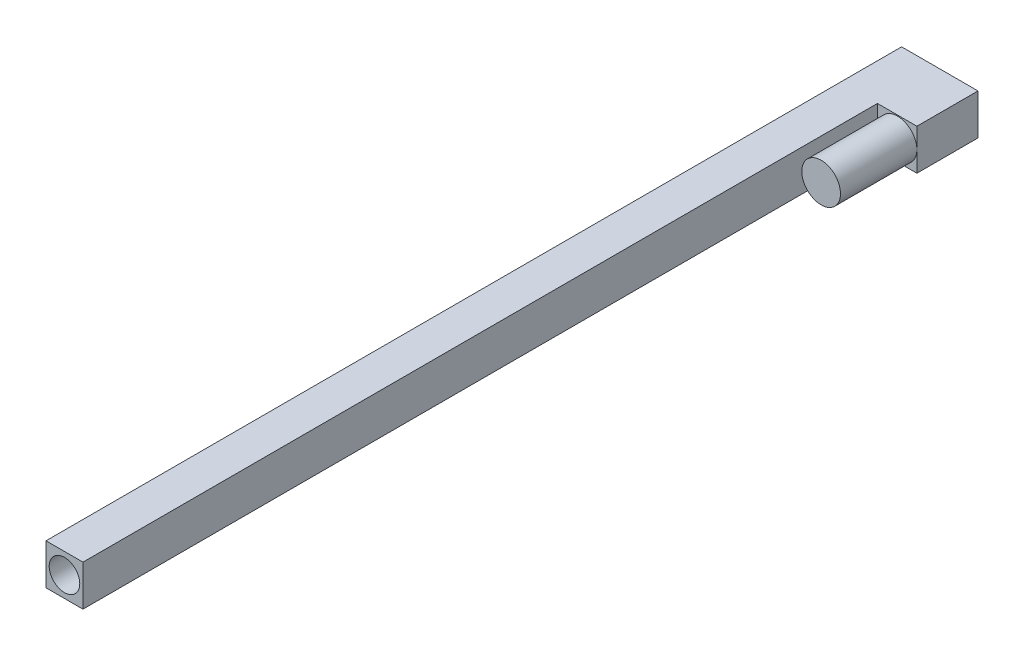
ISO-10303-21;
HEADER;
FILE_DESCRIPTION(('STEP AP214'),'2;1');
FILE_NAME('part.step','',(''),(''),'','','');
FILE_SCHEMA(('AUTOMOTIVE_DESIGN { 1 0 10303 214 1 1 1 1 }'));
ENDSEC;
DATA;
#1=APPLICATION_CONTEXT('core data for automotive mechanical design processes');
#2=APPLICATION_PROTOCOL_DEFINITION('international standard','automotive_design',2000,#1);
#3=PRODUCT_CONTEXT('',#1,'mechanical');
#4=PRODUCT('Part','Part','',(#3));
#5=PRODUCT_RELATED_PRODUCT_CATEGORY('part','',(#4));
#6=PRODUCT_DEFINITION_FORMATION('','',#4);
#7=PRODUCT_DEFINITION_CONTEXT('part definition',#1,'design');
#8=PRODUCT_DEFINITION('design','',#6,#7);
#9=PRODUCT_DEFINITION_SHAPE('','',#8);
#10=(LENGTH_UNIT() NAMED_UNIT(*) SI_UNIT(.MILLI.,.METRE.));
#11=(NAMED_UNIT(*) PLANE_ANGLE_UNIT() SI_UNIT($,.RADIAN.));
#12=(NAMED_UNIT(*) SI_UNIT($,.STERADIAN.) SOLID_ANGLE_UNIT());
#13=UNCERTAINTY_MEASURE_WITH_UNIT(LENGTH_MEASURE(1.E-05),#10,'distance_accuracy_value','');
#14=(GEOMETRIC_REPRESENTATION_CONTEXT(3) GLOBAL_UNCERTAINTY_ASSIGNED_CONTEXT((#13)) GLOBAL_UNIT_ASSIGNED_CONTEXT((#10,
#11,#12)) REPRESENTATION_CONTEXT('',''));
#15=CARTESIAN_POINT('',(0.,0.,0.));
#16=DIRECTION('',(0.,0.,1.));
#17=DIRECTION('',(1.,0.,0.));
#18=AXIS2_PLACEMENT_3D('',#15,#16,#17);
#19=CARTESIAN_POINT('',(0.,0.,60.));
#20=DIRECTION('',(0.,0.,1.));
#21=DIRECTION('',(1.,0.,0.));
#22=AXIS2_PLACEMENT_3D('',#19,#20,#21);
#23=PLANE('',#22);
#24=DIRECTION('',(-1.,0.,0.));
#25=VECTOR('',#24,1.);
#26=CARTESIAN_POINT('',(-44.3742096275442,18.8936170212766,60.));
#27=LINE('',#26,#25);
#28=CARTESIAN_POINT('',(30.6257903724558,18.8936170212766,60.));
#29=VERTEX_POINT('',#28);
#30=CARTESIAN_POINT('',(-8.08444192807477,18.8936170212766,60.));
#31=VERTEX_POINT('',#30);
#32=EDGE_CURVE('E62',#29,#31,#27,.T.);
#33=ORIENTED_EDGE('',*,*,#32,.T.);
#34=DIRECTION('',(0.,1.,0.));
#35=VECTOR('',#34,1.);
#36=CARTESIAN_POINT('',(-8.08444192807477,18.8936170212766,60.));
#37=LINE('',#36,#35);
#38=CARTESIAN_POINT('',(-8.08444192807477,-21.1063829787234,60.));
#39=VERTEX_POINT('',#38);
#40=EDGE_CURVE('E57',#39,#31,#37,.T.);
#41=ORIENTED_EDGE('',*,*,#40,.F.);
#42=DIRECTION('',(1.,0.,0.));
#43=VECTOR('',#42,1.);
#44=CARTESIAN_POINT('',(-44.3742096275442,-21.1063829787234,60.));
#45=LINE('',#44,#43);
#46=CARTESIAN_POINT('',(30.6257903724558,-21.1063829787234,60.));
#47=VERTEX_POINT('',#46);
#48=EDGE_CURVE('E144',#39,#47,#45,.T.);
#49=ORIENTED_EDGE('',*,*,#48,.T.);
#50=DIRECTION('',(0.,1.,0.));
#51=VECTOR('',#50,1.);
#52=CARTESIAN_POINT('',(30.6257903724558,18.8936170212766,60.));
#53=LINE('',#52,#51);
#54=CARTESIAN_POINT('',(30.6257903724558,-1.02570082535449,60.));
#55=VERTEX_POINT('',#54);
#56=EDGE_CURVE('E149',#47,#55,#53,.T.);
#57=ORIENTED_EDGE('',*,*,#56,.T.);
#58=CARTESIAN_POINT('',(11.6257903724558,-1.02570082535449,60.));
#59=DIRECTION('',(0.,0.,1.));
#60=DIRECTION('',(1.,0.,0.));
#61=AXIS2_PLACEMENT_3D('',#58,#59,#60);
#62=CIRCLE('',#61,19.);
#63=EDGE_CURVE('E136',#55,#55,#62,.T.);
#64=ORIENTED_EDGE('',*,*,#63,.F.);
#65=EDGE_CURVE('E147',#55,#29,#53,.T.);
#66=ORIENTED_EDGE('',*,*,#65,.T.);
#67=EDGE_LOOP('',(#33,#41,#49,#57,#64,#66));
#68=FACE_BOUND('',#67,.T.);
#69=ADVANCED_FACE('F41',(#68),#23,.T.);
#70=CARTESIAN_POINT('',(-44.3742096275442,18.8936170212766,60.));
#71=DIRECTION('',(1.,0.,0.));
#72=DIRECTION('',(0.,0.,-1.));
#73=AXIS2_PLACEMENT_3D('',#70,#71,#72);
#74=PLANE('',#73);
#75=DIRECTION('',(0.,-1.,0.));
#76=VECTOR('',#75,1.);
#77=CARTESIAN_POINT('',(-44.3742096275442,18.8936170212766,0.));
#78=LINE('',#77,#76);
#79=CARTESIAN_POINT('',(-44.3742096275442,18.8936170212766,0.));
#80=VERTEX_POINT('',#79);
#81=CARTESIAN_POINT('',(-44.3742096275442,-21.1063829787234,0.));
#82=VERTEX_POINT('',#81);
#83=EDGE_CURVE('E101',#80,#82,#78,.T.);
#84=ORIENTED_EDGE('',*,*,#83,.T.);
#85=DIRECTION('',(0.,0.,-1.));
#86=VECTOR('',#85,1.);
#87=CARTESIAN_POINT('',(-44.3742096275442,-21.1063829787234,60.));
#88=LINE('',#87,#86);
#89=CARTESIAN_POINT('',(-44.3742096275442,-21.1063829787234,840.));
#90=VERTEX_POINT('',#89);
#91=EDGE_CURVE('E11',#90,#82,#88,.T.);
#92=ORIENTED_EDGE('',*,*,#91,.F.);
#93=DIRECTION('',(0.,-1.,0.));
#94=VECTOR('',#93,1.);
#95=CARTESIAN_POINT('',(-44.3742096275442,18.8936170212766,840.));
#96=LINE('',#95,#94);
#97=CARTESIAN_POINT('',(-44.3742096275442,18.8936170212766,840.));
#98=VERTEX_POINT('',#97);
#99=EDGE_CURVE('E99',#98,#90,#96,.T.);
#100=ORIENTED_EDGE('',*,*,#99,.F.);
#101=DIRECTION('',(0.,0.,-1.));
#102=VECTOR('',#101,1.);
#103=CARTESIAN_POINT('',(-44.3742096275442,18.8936170212766,60.));
#104=LINE('',#103,#102);
#105=EDGE_CURVE('E154',#98,#80,#104,.T.);
#106=ORIENTED_EDGE('',*,*,#105,.T.);
#107=EDGE_LOOP('',(#84,#92,#100,#106));
#108=FACE_BOUND('',#107,.T.);
#109=ADVANCED_FACE('F43',(#108),#74,.F.);
#110=CARTESIAN_POINT('',(-44.3742096275442,-21.1063829787234,60.));
#111=DIRECTION('',(0.,1.,0.));
#112=DIRECTION('',(0.,0.,1.));
#113=AXIS2_PLACEMENT_3D('',#110,#111,#112);
#114=PLANE('',#113);
#115=DIRECTION('',(1.,0.,0.));
#116=VECTOR('',#115,1.);
#117=CARTESIAN_POINT('',(-44.3742096275442,-21.1063829787234,0.));
#118=LINE('',#117,#116);
#119=CARTESIAN_POINT('',(30.6257903724558,-21.1063829787234,0.));
#120=VERTEX_POINT('',#119);
#121=EDGE_CURVE('E157',#82,#120,#118,.T.);
#122=ORIENTED_EDGE('',*,*,#121,.T.);
#123=DIRECTION('',(0.,0.,-1.));
#124=VECTOR('',#123,1.);
#125=CARTESIAN_POINT('',(30.6257903724558,-21.1063829787234,60.));
#126=LINE('',#125,#124);
#127=EDGE_CURVE('E50',#47,#120,#126,.T.);
#128=ORIENTED_EDGE('',*,*,#127,.F.);
#129=ORIENTED_EDGE('',*,*,#48,.F.);
#130=DIRECTION('',(0.,0.,-1.));
#131=VECTOR('',#130,1.);
#132=CARTESIAN_POINT('',(-8.08444192807477,-21.1063829787234,840.));
#133=LINE('',#132,#131);
#134=CARTESIAN_POINT('',(-8.08444192807477,-21.1063829787234,840.));
#135=VERTEX_POINT('',#134);
#136=EDGE_CURVE('E107',#135,#39,#133,.T.);
#137=ORIENTED_EDGE('',*,*,#136,.F.);
#138=DIRECTION('',(1.,0.,0.));
#139=VECTOR('',#138,1.);
#140=CARTESIAN_POINT('',(-44.3742096275442,-21.1063829787234,840.));
#141=LINE('',#140,#139);
#142=EDGE_CURVE('E104',#90,#135,#141,.T.);
#143=ORIENTED_EDGE('',*,*,#142,.F.);
#144=ORIENTED_EDGE('',*,*,#91,.T.);
#145=EDGE_LOOP('',(#122,#128,#129,#137,#143,#144));
#146=FACE_BOUND('',#145,.T.);
#147=ADVANCED_FACE('F105',(#146),#114,.F.);
#148=CARTESIAN_POINT('',(30.6257903724558,18.8936170212766,60.));
#149=DIRECTION('',(-1.,0.,0.));
#150=DIRECTION('',(0.,0.,1.));
#151=AXIS2_PLACEMENT_3D('',#148,#149,#150);
#152=PLANE('',#151);
#153=DIRECTION('',(0.,1.,0.));
#154=VECTOR('',#153,1.);
#155=CARTESIAN_POINT('',(30.6257903724558,18.8936170212766,0.));
#156=LINE('',#155,#154);
#157=CARTESIAN_POINT('',(30.6257903724558,18.8936170212766,0.));
#158=VERTEX_POINT('',#157);
#159=EDGE_CURVE('E160',#120,#158,#156,.T.);
#160=ORIENTED_EDGE('',*,*,#159,.T.);
#161=DIRECTION('',(0.,0.,-1.));
#162=VECTOR('',#161,1.);
#163=CARTESIAN_POINT('',(30.6257903724558,18.8936170212766,60.));
#164=LINE('',#163,#162);
#165=EDGE_CURVE('E167',#29,#158,#164,.T.);
#166=ORIENTED_EDGE('',*,*,#165,.F.);
#167=ORIENTED_EDGE('',*,*,#65,.F.);
#168=ORIENTED_EDGE('',*,*,#56,.F.);
#169=ORIENTED_EDGE('',*,*,#127,.T.);
#170=EDGE_LOOP('',(#160,#166,#167,#168,#169));
#171=FACE_BOUND('',#170,.T.);
#172=ADVANCED_FACE('F176',(#171),#152,.F.);
#173=CARTESIAN_POINT('',(-44.3742096275442,18.8936170212766,60.));
#174=DIRECTION('',(0.,-1.,0.));
#175=DIRECTION('',(0.,0.,-1.));
#176=AXIS2_PLACEMENT_3D('',#173,#174,#175);
#177=PLANE('',#176);
#178=DIRECTION('',(-1.,0.,0.));
#179=VECTOR('',#178,1.);
#180=CARTESIAN_POINT('',(-44.3742096275442,18.8936170212766,0.));
#181=LINE('',#180,#179);
#182=EDGE_CURVE('E148',#158,#80,#181,.T.);
#183=ORIENTED_EDGE('',*,*,#182,.T.);
#184=ORIENTED_EDGE('',*,*,#105,.F.);
#185=DIRECTION('',(-1.,0.,0.));
#186=VECTOR('',#185,1.);
#187=CARTESIAN_POINT('',(-44.3742096275442,18.8936170212766,840.));
#188=LINE('',#187,#186);
#189=CARTESIAN_POINT('',(-8.08444192807477,18.8936170212766,840.));
#190=VERTEX_POINT('',#189);
#191=EDGE_CURVE('E116',#190,#98,#188,.T.);
#192=ORIENTED_EDGE('',*,*,#191,.F.);
#193=DIRECTION('',(0.,0.,-1.));
#194=VECTOR('',#193,1.);
#195=CARTESIAN_POINT('',(-8.08444192807477,18.8936170212766,840.));
#196=LINE('',#195,#194);
#197=EDGE_CURVE('E129',#190,#31,#196,.T.);
#198=ORIENTED_EDGE('',*,*,#197,.T.);
#199=ORIENTED_EDGE('',*,*,#32,.F.);
#200=ORIENTED_EDGE('',*,*,#165,.T.);
#201=EDGE_LOOP('',(#183,#184,#192,#198,#199,#200));
#202=FACE_BOUND('',#201,.T.);
#203=ADVANCED_FACE('F183',(#202),#177,.F.);
#204=CARTESIAN_POINT('',(0.,0.,0.));
#205=DIRECTION('',(0.,0.,1.));
#206=DIRECTION('',(1.,0.,0.));
#207=AXIS2_PLACEMENT_3D('',#204,#205,#206);
#208=PLANE('',#207);
#209=ORIENTED_EDGE('',*,*,#83,.F.);
#210=ORIENTED_EDGE('',*,*,#182,.F.);
#211=ORIENTED_EDGE('',*,*,#159,.F.);
#212=ORIENTED_EDGE('',*,*,#121,.F.);
#213=EDGE_LOOP('',(#209,#210,#211,#212));
#214=FACE_BOUND('',#213,.T.);
#215=ADVANCED_FACE('F181',(#214),#208,.F.);
#216=CARTESIAN_POINT('',(11.6257903724558,-1.02570082535449,135.));
#217=DIRECTION('',(0.,0.,-1.));
#218=DIRECTION('',(-1.,0.,0.));
#219=AXIS2_PLACEMENT_3D('',#216,#217,#218);
#220=CYLINDRICAL_SURFACE('',#219,19.);
#221=CARTESIAN_POINT('',(11.6257903724558,-1.02570082535449,135.));
#222=DIRECTION('',(0.,0.,1.));
#223=DIRECTION('',(1.,0.,0.));
#224=AXIS2_PLACEMENT_3D('',#221,#222,#223);
#225=CIRCLE('',#224,19.);
#226=CARTESIAN_POINT('',(30.6257903724558,-1.02570082535449,135.));
#227=VERTEX_POINT('',#226);
#228=EDGE_CURVE('E137',#227,#227,#225,.T.);
#229=ORIENTED_EDGE('',*,*,#228,.F.);
#230=EDGE_LOOP('',(#229));
#231=FACE_BOUND('',#230,.T.);
#232=ORIENTED_EDGE('',*,*,#63,.T.);
#233=EDGE_LOOP('',(#232));
#234=FACE_BOUND('',#233,.T.);
#235=ADVANCED_FACE('F187',(#231,#234),#220,.T.);
#236=CARTESIAN_POINT('',(11.6257903724558,-1.02570082535449,135.));
#237=DIRECTION('',(0.,0.,1.));
#238=DIRECTION('',(1.,0.,0.));
#239=AXIS2_PLACEMENT_3D('',#236,#237,#238);
#240=PLANE('',#239);
#241=ORIENTED_EDGE('',*,*,#228,.T.);
#242=EDGE_LOOP('',(#241));
#243=FACE_BOUND('',#242,.T.);
#244=ADVANCED_FACE('F189',(#243),#240,.T.);
#245=CARTESIAN_POINT('',(-8.08444192807477,18.8936170212766,840.));
#246=DIRECTION('',(-1.,0.,0.));
#247=DIRECTION('',(0.,0.,1.));
#248=AXIS2_PLACEMENT_3D('',#245,#246,#247);
#249=PLANE('',#248);
#250=ORIENTED_EDGE('',*,*,#40,.T.);
#251=ORIENTED_EDGE('',*,*,#197,.F.);
#252=DIRECTION('',(0.,1.,0.));
#253=VECTOR('',#252,1.);
#254=CARTESIAN_POINT('',(-8.08444192807477,18.8936170212766,840.));
#255=LINE('',#254,#253);
#256=EDGE_CURVE('E111',#135,#190,#255,.T.);
#257=ORIENTED_EDGE('',*,*,#256,.F.);
#258=ORIENTED_EDGE('',*,*,#136,.T.);
#259=EDGE_LOOP('',(#250,#251,#257,#258));
#260=FACE_BOUND('',#259,.T.);
#261=ADVANCED_FACE('F196',(#260),#249,.F.);
#262=CARTESIAN_POINT('',(0.,0.,840.));
#263=DIRECTION('',(0.,0.,1.));
#264=DIRECTION('',(1.,0.,0.));
#265=AXIS2_PLACEMENT_3D('',#262,#263,#264);
#266=PLANE('',#265);
#267=CARTESIAN_POINT('',(-26.2293257778095,-1.1063829787234,840.));
#268=DIRECTION('',(0.,0.,1.));
#269=DIRECTION('',(1.,0.,0.));
#270=AXIS2_PLACEMENT_3D('',#267,#268,#269);
#271=CIRCLE('',#270,15.);
#272=CARTESIAN_POINT('',(-11.2293257778095,-1.1063829787234,840.));
#273=VERTEX_POINT('',#272);
#274=EDGE_CURVE('E123',#273,#273,#271,.T.);
#275=ORIENTED_EDGE('',*,*,#274,.F.);
#276=EDGE_LOOP('',(#275));
#277=FACE_BOUND('',#276,.T.);
#278=ORIENTED_EDGE('',*,*,#99,.T.);
#279=ORIENTED_EDGE('',*,*,#142,.T.);
#280=ORIENTED_EDGE('',*,*,#256,.T.);
#281=ORIENTED_EDGE('',*,*,#191,.T.);
#282=EDGE_LOOP('',(#278,#279,#280,#281));
#283=FACE_BOUND('',#282,.T.);
#284=ADVANCED_FACE('F114',(#277,#283),#266,.T.);
#285=CARTESIAN_POINT('',(-26.2293257778095,-1.1063829787234,40.));
#286=DIRECTION('',(0.,0.,1.));
#287=DIRECTION('',(1.,0.,0.));
#288=AXIS2_PLACEMENT_3D('',#285,#286,#287);
#289=CYLINDRICAL_SURFACE('',#288,15.);
#290=CARTESIAN_POINT('',(-26.2293257778095,-1.1063829787234,40.));
#291=DIRECTION('',(0.,0.,1.));
#292=DIRECTION('',(1.,0.,0.));
#293=AXIS2_PLACEMENT_3D('',#290,#291,#292);
#294=CIRCLE('',#293,15.);
#295=CARTESIAN_POINT('',(-11.2293257778095,-1.1063829787234,40.));
#296=VERTEX_POINT('',#295);
#297=EDGE_CURVE('E120',#296,#296,#294,.T.);
#298=ORIENTED_EDGE('',*,*,#297,.F.);
#299=EDGE_LOOP('',(#298));
#300=FACE_BOUND('',#299,.T.);
#301=ORIENTED_EDGE('',*,*,#274,.T.);
#302=EDGE_LOOP('',(#301));
#303=FACE_BOUND('',#302,.T.);
#304=ADVANCED_FACE('F286',(#300,#303),#289,.F.);
#305=CARTESIAN_POINT('',(-26.2293257778095,-1.1063829787234,40.));
#306=DIRECTION('',(0.,0.,1.));
#307=DIRECTION('',(1.,0.,0.));
#308=AXIS2_PLACEMENT_3D('',#305,#306,#307);
#309=PLANE('',#308);
#310=ORIENTED_EDGE('',*,*,#297,.T.);
#311=EDGE_LOOP('',(#310));
#312=FACE_BOUND('',#311,.T.);
#313=ADVANCED_FACE('F296',(#312),#309,.T.);
#314=CLOSED_SHELL('',(#69,#109,#147,#172,#203,#215,#235,#244,#261,#284,#304,#313));
#315=MANIFOLD_SOLID_BREP('B2',#314);
#316=ADVANCED_BREP_SHAPE_REPRESENTATION('',(#18,#315),#14);
#317=SHAPE_DEFINITION_REPRESENTATION(#9,#316);
ENDSEC;
END-ISO-10303-21;
